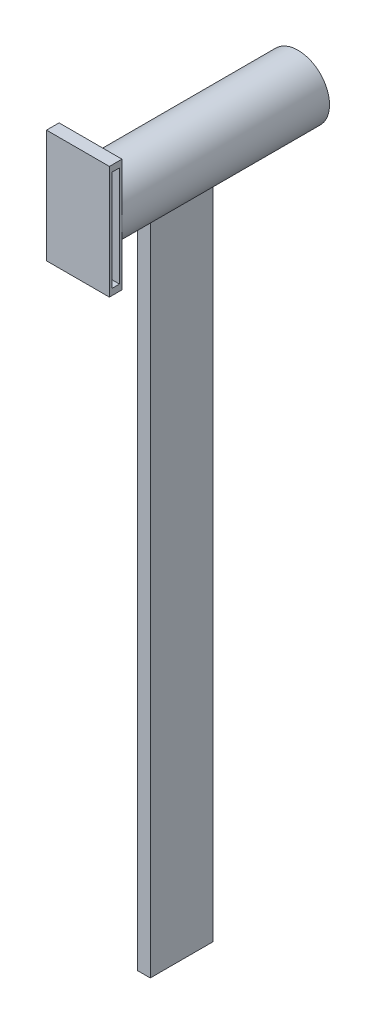
ISO-10303-21;
HEADER;
FILE_DESCRIPTION(('STEP AP214'),'2;1');
FILE_NAME('part.step','',(''),(''),'','','');
FILE_SCHEMA(('AUTOMOTIVE_DESIGN { 1 0 10303 214 1 1 1 1 }'));
ENDSEC;
DATA;
#1=APPLICATION_CONTEXT('core data for automotive mechanical design processes');
#2=APPLICATION_PROTOCOL_DEFINITION('international standard','automotive_design',2000,#1);
#3=PRODUCT_CONTEXT('',#1,'mechanical');
#4=PRODUCT('Part','Part','',(#3));
#5=PRODUCT_RELATED_PRODUCT_CATEGORY('part','',(#4));
#6=PRODUCT_DEFINITION_FORMATION('','',#4);
#7=PRODUCT_DEFINITION_CONTEXT('part definition',#1,'design');
#8=PRODUCT_DEFINITION('design','',#6,#7);
#9=PRODUCT_DEFINITION_SHAPE('','',#8);
#10=(LENGTH_UNIT() NAMED_UNIT(*) SI_UNIT(.MILLI.,.METRE.));
#11=(NAMED_UNIT(*) PLANE_ANGLE_UNIT() SI_UNIT($,.RADIAN.));
#12=(NAMED_UNIT(*) SI_UNIT($,.STERADIAN.) SOLID_ANGLE_UNIT());
#13=UNCERTAINTY_MEASURE_WITH_UNIT(LENGTH_MEASURE(1.E-05),#10,'distance_accuracy_value','');
#14=(GEOMETRIC_REPRESENTATION_CONTEXT(3) GLOBAL_UNCERTAINTY_ASSIGNED_CONTEXT((#13)) GLOBAL_UNIT_ASSIGNED_CONTEXT((#10,
#11,#12)) REPRESENTATION_CONTEXT('',''));
#15=CARTESIAN_POINT('',(0.,0.,0.));
#16=DIRECTION('',(0.,0.,1.));
#17=DIRECTION('',(1.,0.,0.));
#18=AXIS2_PLACEMENT_3D('',#15,#16,#17);
#19=CARTESIAN_POINT('',(0.,0.,0.));
#20=DIRECTION('',(0.,0.,1.));
#21=DIRECTION('',(1.,0.,0.));
#22=AXIS2_PLACEMENT_3D('',#19,#20,#21);
#23=PLANE('',#22);
#24=CARTESIAN_POINT('',(0.,0.,0.));
#25=DIRECTION('',(0.,0.,1.));
#26=DIRECTION('',(1.,0.,0.));
#27=AXIS2_PLACEMENT_3D('',#24,#25,#26);
#28=CIRCLE('',#27,2.5);
#29=CARTESIAN_POINT('',(2.5,0.,0.));
#30=VERTEX_POINT('',#29);
#31=EDGE_CURVE('E187',#30,#30,#28,.T.);
#32=ORIENTED_EDGE('',*,*,#31,.F.);
#33=EDGE_LOOP('',(#32));
#34=FACE_BOUND('',#33,.T.);
#35=ADVANCED_FACE('F37',(#34),#23,.F.);
#36=CARTESIAN_POINT('',(0.,0.,0.));
#37=DIRECTION('',(0.,0.,1.));
#38=DIRECTION('',(1.,0.,0.));
#39=AXIS2_PLACEMENT_3D('',#36,#37,#38);
#40=CYLINDRICAL_SURFACE('',#39,2.5);
#41=DIRECTION('',(0.,0.,1.));
#42=VECTOR('',#41,1.);
#43=CARTESIAN_POINT('',(-0.500000000000001,-2.44948974278318,0.));
#44=LINE('',#43,#42);
#45=CARTESIAN_POINT('',(-0.499999999999999,-2.44948974278318,12.25));
#46=VERTEX_POINT('',#45);
#47=CARTESIAN_POINT('',(-0.5,-2.44948974278318,7.25));
#48=VERTEX_POINT('',#47);
#49=EDGE_CURVE('E135',#46,#48,#44,.F.);
#50=ORIENTED_EDGE('',*,*,#49,.F.);
#51=CARTESIAN_POINT('',(0.,0.,12.25));
#52=DIRECTION('',(0.,0.,1.));
#53=DIRECTION('',(1.,0.,0.));
#54=AXIS2_PLACEMENT_3D('',#51,#52,#53);
#55=CIRCLE('',#54,2.5);
#56=CARTESIAN_POINT('',(0.500000000000001,-2.44948974278318,12.25));
#57=VERTEX_POINT('',#56);
#58=EDGE_CURVE('E155',#57,#46,#55,.F.);
#59=ORIENTED_EDGE('',*,*,#58,.F.);
#60=DIRECTION('',(0.,0.,1.));
#61=VECTOR('',#60,1.);
#62=CARTESIAN_POINT('',(0.5,-2.44948974278318,0.));
#63=LINE('',#62,#61);
#64=CARTESIAN_POINT('',(0.5,-2.44948974278318,7.25));
#65=VERTEX_POINT('',#64);
#66=EDGE_CURVE('E166',#65,#57,#63,.T.);
#67=ORIENTED_EDGE('',*,*,#66,.F.);
#68=CARTESIAN_POINT('',(0.,0.,7.25));
#69=DIRECTION('',(0.,0.,-1.));
#70=DIRECTION('',(-1.,0.,0.));
#71=AXIS2_PLACEMENT_3D('',#68,#69,#70);
#72=CIRCLE('',#71,2.5);
#73=EDGE_CURVE('E169',#48,#65,#72,.F.);
#74=ORIENTED_EDGE('',*,*,#73,.F.);
#75=EDGE_LOOP('',(#50,#59,#67,#74));
#76=FACE_BOUND('',#75,.T.);
#77=CARTESIAN_POINT('',(0.,0.,16.5));
#78=DIRECTION('',(0.,0.,1.));
#79=DIRECTION('',(1.,0.,0.));
#80=AXIS2_PLACEMENT_3D('',#77,#78,#79);
#81=CIRCLE('',#80,2.5);
#82=CARTESIAN_POINT('',(2.5,0.,16.5));
#83=VERTEX_POINT('',#82);
#84=CARTESIAN_POINT('',(-2.50000000032777,-0.000543972037433699,16.5));
#85=VERTEX_POINT('',#84);
#86=EDGE_CURVE('E151',#83,#85,#81,.T.);
#87=ORIENTED_EDGE('',*,*,#86,.F.);
#88=EDGE_CURVE('E156',#85,#83,#81,.T.);
#89=ORIENTED_EDGE('',*,*,#88,.F.);
#90=EDGE_LOOP('',(#87,#89));
#91=FACE_BOUND('',#90,.T.);
#92=ORIENTED_EDGE('',*,*,#31,.T.);
#93=EDGE_LOOP('',(#92));
#94=FACE_BOUND('',#93,.T.);
#95=ADVANCED_FACE('F39',(#76,#91,#94),#40,.T.);
#96=CARTESIAN_POINT('',(-0.5,-55.,7.25));
#97=DIRECTION('',(-1.,0.,0.));
#98=DIRECTION('',(0.,0.,1.));
#99=AXIS2_PLACEMENT_3D('',#96,#97,#98);
#100=PLANE('',#99);
#101=DIRECTION('',(0.,1.,0.));
#102=VECTOR('',#101,1.);
#103=CARTESIAN_POINT('',(-0.499999999999999,-55.,12.25));
#104=LINE('',#103,#102);
#105=CARTESIAN_POINT('',(-0.499999999999999,-55.,12.25));
#106=VERTEX_POINT('',#105);
#107=EDGE_CURVE('E179',#106,#46,#104,.T.);
#108=ORIENTED_EDGE('',*,*,#107,.T.);
#109=ORIENTED_EDGE('',*,*,#49,.T.);
#110=DIRECTION('',(0.,1.,0.));
#111=VECTOR('',#110,1.);
#112=CARTESIAN_POINT('',(-0.5,-55.,7.25));
#113=LINE('',#112,#111);
#114=CARTESIAN_POINT('',(-0.5,-55.,7.25));
#115=VERTEX_POINT('',#114);
#116=EDGE_CURVE('E177',#115,#48,#113,.T.);
#117=ORIENTED_EDGE('',*,*,#116,.F.);
#118=DIRECTION('',(0.,0.,1.));
#119=VECTOR('',#118,1.);
#120=CARTESIAN_POINT('',(-0.5,-55.,7.25));
#121=LINE('',#120,#119);
#122=EDGE_CURVE('E331',#115,#106,#121,.T.);
#123=ORIENTED_EDGE('',*,*,#122,.T.);
#124=EDGE_LOOP('',(#108,#109,#117,#123));
#125=FACE_BOUND('',#124,.T.);
#126=ADVANCED_FACE('F175',(#125),#100,.T.);
#127=CARTESIAN_POINT('',(-0.5,-55.,7.25));
#128=DIRECTION('',(0.,0.,-1.));
#129=DIRECTION('',(-1.,0.,0.));
#130=AXIS2_PLACEMENT_3D('',#127,#128,#129);
#131=PLANE('',#130);
#132=ORIENTED_EDGE('',*,*,#116,.T.);
#133=ORIENTED_EDGE('',*,*,#73,.T.);
#134=DIRECTION('',(0.,1.,0.));
#135=VECTOR('',#134,1.);
#136=CARTESIAN_POINT('',(0.500000000000001,-55.,7.25));
#137=LINE('',#136,#135);
#138=CARTESIAN_POINT('',(0.500000000000001,-55.,7.25));
#139=VERTEX_POINT('',#138);
#140=EDGE_CURVE('E188',#139,#65,#137,.T.);
#141=ORIENTED_EDGE('',*,*,#140,.F.);
#142=DIRECTION('',(-1.,0.,0.));
#143=VECTOR('',#142,1.);
#144=CARTESIAN_POINT('',(-0.5,-55.,7.25));
#145=LINE('',#144,#143);
#146=EDGE_CURVE('E186',#139,#115,#145,.T.);
#147=ORIENTED_EDGE('',*,*,#146,.T.);
#148=EDGE_LOOP('',(#132,#133,#141,#147));
#149=FACE_BOUND('',#148,.T.);
#150=ADVANCED_FACE('F183',(#149),#131,.T.);
#151=CARTESIAN_POINT('',(0.500000000000001,-55.,7.25));
#152=DIRECTION('',(1.,0.,0.));
#153=DIRECTION('',(0.,0.,-1.));
#154=AXIS2_PLACEMENT_3D('',#151,#152,#153);
#155=PLANE('',#154);
#156=ORIENTED_EDGE('',*,*,#140,.T.);
#157=ORIENTED_EDGE('',*,*,#66,.T.);
#158=DIRECTION('',(0.,1.,0.));
#159=VECTOR('',#158,1.);
#160=CARTESIAN_POINT('',(0.500000000000001,-55.,12.25));
#161=LINE('',#160,#159);
#162=CARTESIAN_POINT('',(0.500000000000001,-55.,12.25));
#163=VERTEX_POINT('',#162);
#164=EDGE_CURVE('E191',#163,#57,#161,.T.);
#165=ORIENTED_EDGE('',*,*,#164,.F.);
#166=DIRECTION('',(0.,0.,-1.));
#167=VECTOR('',#166,1.);
#168=CARTESIAN_POINT('',(0.500000000000001,-55.,7.25));
#169=LINE('',#168,#167);
#170=EDGE_CURVE('E336',#163,#139,#169,.T.);
#171=ORIENTED_EDGE('',*,*,#170,.T.);
#172=EDGE_LOOP('',(#156,#157,#165,#171));
#173=FACE_BOUND('',#172,.T.);
#174=ADVANCED_FACE('F228',(#173),#155,.T.);
#175=CARTESIAN_POINT('',(-0.499999999999999,-55.,12.25));
#176=DIRECTION('',(0.,0.,1.));
#177=DIRECTION('',(1.,0.,0.));
#178=AXIS2_PLACEMENT_3D('',#175,#176,#177);
#179=PLANE('',#178);
#180=ORIENTED_EDGE('',*,*,#164,.T.);
#181=ORIENTED_EDGE('',*,*,#58,.T.);
#182=ORIENTED_EDGE('',*,*,#107,.F.);
#183=DIRECTION('',(1.,0.,0.));
#184=VECTOR('',#183,1.);
#185=CARTESIAN_POINT('',(-0.499999999999999,-55.,12.25));
#186=LINE('',#185,#184);
#187=EDGE_CURVE('E334',#106,#163,#186,.T.);
#188=ORIENTED_EDGE('',*,*,#187,.T.);
#189=EDGE_LOOP('',(#180,#181,#182,#188));
#190=FACE_BOUND('',#189,.T.);
#191=ADVANCED_FACE('F224',(#190),#179,.T.);
#192=CARTESIAN_POINT('',(0.,-55.,0.));
#193=DIRECTION('',(0.,1.,0.));
#194=DIRECTION('',(0.,0.,1.));
#195=AXIS2_PLACEMENT_3D('',#192,#193,#194);
#196=PLANE('',#195);
#197=ORIENTED_EDGE('',*,*,#122,.F.);
#198=ORIENTED_EDGE('',*,*,#146,.F.);
#199=ORIENTED_EDGE('',*,*,#170,.F.);
#200=ORIENTED_EDGE('',*,*,#187,.F.);
#201=EDGE_LOOP('',(#197,#198,#199,#200));
#202=FACE_BOUND('',#201,.T.);
#203=ADVANCED_FACE('F227',(#202),#196,.F.);
#204=CARTESIAN_POINT('',(0.,0.,16.5));
#205=DIRECTION('',(0.,0.,1.));
#206=DIRECTION('',(1.,0.,0.));
#207=AXIS2_PLACEMENT_3D('',#204,#205,#206);
#208=PLANE('',#207);
#209=DIRECTION('',(0.,-1.,0.));
#210=VECTOR('',#209,1.);
#211=CARTESIAN_POINT('',(2.5,0.,16.5));
#212=LINE('',#211,#210);
#213=CARTESIAN_POINT('',(2.5,4.5,16.5));
#214=VERTEX_POINT('',#213);
#215=EDGE_CURVE('E317',#214,#83,#212,.T.);
#216=ORIENTED_EDGE('',*,*,#215,.T.);
#217=ORIENTED_EDGE('',*,*,#86,.T.);
#218=DIRECTION('',(0.,-1.,0.));
#219=VECTOR('',#218,1.);
#220=CARTESIAN_POINT('',(-2.5,0.,16.5));
#221=LINE('',#220,#219);
#222=CARTESIAN_POINT('',(-2.5,4.5,16.5));
#223=VERTEX_POINT('',#222);
#224=EDGE_CURVE('E312',#223,#85,#221,.T.);
#225=ORIENTED_EDGE('',*,*,#224,.F.);
#226=DIRECTION('',(1.,0.,0.));
#227=VECTOR('',#226,1.);
#228=CARTESIAN_POINT('',(0.,4.5,16.5));
#229=LINE('',#228,#227);
#230=EDGE_CURVE('E295',#223,#214,#229,.T.);
#231=ORIENTED_EDGE('',*,*,#230,.T.);
#232=EDGE_LOOP('',(#216,#217,#225,#231));
#233=FACE_BOUND('',#232,.T.);
#234=ADVANCED_FACE('F237',(#233),#208,.F.);
#235=CARTESIAN_POINT('',(-2.5,-4.5,16.5));
#236=VERTEX_POINT('',#235);
#237=EDGE_CURVE('E290',#85,#236,#221,.T.);
#238=ORIENTED_EDGE('',*,*,#237,.F.);
#239=ORIENTED_EDGE('',*,*,#88,.T.);
#240=CARTESIAN_POINT('',(2.5,-4.5,16.5));
#241=VERTEX_POINT('',#240);
#242=EDGE_CURVE('E315',#83,#241,#212,.T.);
#243=ORIENTED_EDGE('',*,*,#242,.T.);
#244=DIRECTION('',(1.,0.,0.));
#245=VECTOR('',#244,1.);
#246=CARTESIAN_POINT('',(0.,-4.5,16.5));
#247=LINE('',#246,#245);
#248=EDGE_CURVE('E306',#236,#241,#247,.T.);
#249=ORIENTED_EDGE('',*,*,#248,.F.);
#250=EDGE_LOOP('',(#238,#239,#243,#249));
#251=FACE_BOUND('',#250,.T.);
#252=ADVANCED_FACE('F243',(#251),#208,.F.);
#253=CARTESIAN_POINT('',(-2.5,0.,17.5));
#254=DIRECTION('',(1.,0.,0.));
#255=DIRECTION('',(0.,0.,-1.));
#256=AXIS2_PLACEMENT_3D('',#253,#254,#255);
#257=PLANE('',#256);
#258=DIRECTION('',(0.,0.,1.));
#259=VECTOR('',#258,1.);
#260=CARTESIAN_POINT('',(-2.5,4.,17.5));
#261=LINE('',#260,#259);
#262=CARTESIAN_POINT('',(-2.5,4.,16.7));
#263=VERTEX_POINT('',#262);
#264=CARTESIAN_POINT('',(-2.5,4.,17.3));
#265=VERTEX_POINT('',#264);
#266=EDGE_CURVE('E277',#263,#265,#261,.T.);
#267=ORIENTED_EDGE('',*,*,#266,.T.);
#268=DIRECTION('',(0.,-1.,0.));
#269=VECTOR('',#268,1.);
#270=CARTESIAN_POINT('',(-2.5,0.,17.3));
#271=LINE('',#270,#269);
#272=CARTESIAN_POINT('',(-2.5,-4.,17.3));
#273=VERTEX_POINT('',#272);
#274=EDGE_CURVE('E287',#265,#273,#271,.T.);
#275=ORIENTED_EDGE('',*,*,#274,.T.);
#276=DIRECTION('',(0.,0.,-1.));
#277=VECTOR('',#276,1.);
#278=CARTESIAN_POINT('',(-2.5,-4.,17.5));
#279=LINE('',#278,#277);
#280=CARTESIAN_POINT('',(-2.5,-4.,16.7));
#281=VERTEX_POINT('',#280);
#282=EDGE_CURVE('E280',#273,#281,#279,.T.);
#283=ORIENTED_EDGE('',*,*,#282,.T.);
#284=DIRECTION('',(0.,1.,0.));
#285=VECTOR('',#284,1.);
#286=CARTESIAN_POINT('',(-2.5,0.,16.7));
#287=LINE('',#286,#285);
#288=EDGE_CURVE('E142',#281,#263,#287,.T.);
#289=ORIENTED_EDGE('',*,*,#288,.T.);
#290=EDGE_LOOP('',(#267,#275,#283,#289));
#291=FACE_BOUND('',#290,.T.);
#292=ORIENTED_EDGE('',*,*,#224,.T.);
#293=ORIENTED_EDGE('',*,*,#237,.T.);
#294=DIRECTION('',(0.,0.,-1.));
#295=VECTOR('',#294,1.);
#296=CARTESIAN_POINT('',(-2.5,-4.5,17.5));
#297=LINE('',#296,#295);
#298=CARTESIAN_POINT('',(-2.5,-4.5,17.5));
#299=VERTEX_POINT('',#298);
#300=EDGE_CURVE('E329',#299,#236,#297,.T.);
#301=ORIENTED_EDGE('',*,*,#300,.F.);
#302=DIRECTION('',(0.,-1.,0.));
#303=VECTOR('',#302,1.);
#304=CARTESIAN_POINT('',(-2.5,0.,17.5));
#305=LINE('',#304,#303);
#306=CARTESIAN_POINT('',(-2.5,4.5,17.5));
#307=VERTEX_POINT('',#306);
#308=EDGE_CURVE('E291',#307,#299,#305,.T.);
#309=ORIENTED_EDGE('',*,*,#308,.F.);
#310=DIRECTION('',(0.,0.,-1.));
#311=VECTOR('',#310,1.);
#312=CARTESIAN_POINT('',(-2.5,4.5,17.5));
#313=LINE('',#312,#311);
#314=EDGE_CURVE('E303',#307,#223,#313,.T.);
#315=ORIENTED_EDGE('',*,*,#314,.T.);
#316=EDGE_LOOP('',(#292,#293,#301,#309,#315));
#317=FACE_BOUND('',#316,.T.);
#318=ADVANCED_FACE('F239',(#291,#317),#257,.F.);
#319=CARTESIAN_POINT('',(0.,-4.5,17.5));
#320=DIRECTION('',(0.,1.,0.));
#321=DIRECTION('',(0.,0.,1.));
#322=AXIS2_PLACEMENT_3D('',#319,#320,#321);
#323=PLANE('',#322);
#324=ORIENTED_EDGE('',*,*,#248,.T.);
#325=DIRECTION('',(0.,0.,-1.));
#326=VECTOR('',#325,1.);
#327=CARTESIAN_POINT('',(2.5,-4.5,17.5));
#328=LINE('',#327,#326);
#329=CARTESIAN_POINT('',(2.5,-4.5,17.5));
#330=VERTEX_POINT('',#329);
#331=EDGE_CURVE('E327',#330,#241,#328,.T.);
#332=ORIENTED_EDGE('',*,*,#331,.F.);
#333=DIRECTION('',(1.,0.,0.));
#334=VECTOR('',#333,1.);
#335=CARTESIAN_POINT('',(0.,-4.5,17.5));
#336=LINE('',#335,#334);
#337=EDGE_CURVE('E294',#299,#330,#336,.T.);
#338=ORIENTED_EDGE('',*,*,#337,.F.);
#339=ORIENTED_EDGE('',*,*,#300,.T.);
#340=EDGE_LOOP('',(#324,#332,#338,#339));
#341=FACE_BOUND('',#340,.T.);
#342=ADVANCED_FACE('F242',(#341),#323,.F.);
#343=CARTESIAN_POINT('',(2.5,0.,17.5));
#344=DIRECTION('',(1.,0.,0.));
#345=DIRECTION('',(0.,0.,-1.));
#346=AXIS2_PLACEMENT_3D('',#343,#344,#345);
#347=PLANE('',#346);
#348=DIRECTION('',(0.,-1.,0.));
#349=VECTOR('',#348,1.);
#350=CARTESIAN_POINT('',(2.5,0.,17.3));
#351=LINE('',#350,#349);
#352=CARTESIAN_POINT('',(2.5,4.,17.3));
#353=VERTEX_POINT('',#352);
#354=CARTESIAN_POINT('',(2.5,-4.,17.3));
#355=VERTEX_POINT('',#354);
#356=EDGE_CURVE('E12',#353,#355,#351,.T.);
#357=ORIENTED_EDGE('',*,*,#356,.F.);
#358=DIRECTION('',(0.,0.,1.));
#359=VECTOR('',#358,1.);
#360=CARTESIAN_POINT('',(2.5,4.,17.5));
#361=LINE('',#360,#359);
#362=CARTESIAN_POINT('',(2.5,4.,16.7));
#363=VERTEX_POINT('',#362);
#364=EDGE_CURVE('E46',#363,#353,#361,.T.);
#365=ORIENTED_EDGE('',*,*,#364,.F.);
#366=DIRECTION('',(0.,1.,0.));
#367=VECTOR('',#366,1.);
#368=CARTESIAN_POINT('',(2.5,0.,16.7));
#369=LINE('',#368,#367);
#370=CARTESIAN_POINT('',(2.5,-4.,16.7));
#371=VERTEX_POINT('',#370);
#372=EDGE_CURVE('E134',#371,#363,#369,.T.);
#373=ORIENTED_EDGE('',*,*,#372,.F.);
#374=DIRECTION('',(0.,0.,-1.));
#375=VECTOR('',#374,1.);
#376=CARTESIAN_POINT('',(2.5,-4.,17.5));
#377=LINE('',#376,#375);
#378=EDGE_CURVE('E129',#355,#371,#377,.T.);
#379=ORIENTED_EDGE('',*,*,#378,.F.);
#380=EDGE_LOOP('',(#357,#365,#373,#379));
#381=FACE_BOUND('',#380,.T.);
#382=ORIENTED_EDGE('',*,*,#215,.F.);
#383=DIRECTION('',(0.,0.,-1.));
#384=VECTOR('',#383,1.);
#385=CARTESIAN_POINT('',(2.5,4.5,17.5));
#386=LINE('',#385,#384);
#387=CARTESIAN_POINT('',(2.5,4.5,17.5));
#388=VERTEX_POINT('',#387);
#389=EDGE_CURVE('E325',#388,#214,#386,.T.);
#390=ORIENTED_EDGE('',*,*,#389,.F.);
#391=DIRECTION('',(0.,-1.,0.));
#392=VECTOR('',#391,1.);
#393=CARTESIAN_POINT('',(2.5,0.,17.5));
#394=LINE('',#393,#392);
#395=EDGE_CURVE('E297',#388,#330,#394,.T.);
#396=ORIENTED_EDGE('',*,*,#395,.T.);
#397=ORIENTED_EDGE('',*,*,#331,.T.);
#398=ORIENTED_EDGE('',*,*,#242,.F.);
#399=EDGE_LOOP('',(#382,#390,#396,#397,#398));
#400=FACE_BOUND('',#399,.T.);
#401=ADVANCED_FACE('F147',(#381,#400),#347,.T.);
#402=CARTESIAN_POINT('',(0.,4.5,17.5));
#403=DIRECTION('',(0.,1.,0.));
#404=DIRECTION('',(0.,0.,1.));
#405=AXIS2_PLACEMENT_3D('',#402,#403,#404);
#406=PLANE('',#405);
#407=ORIENTED_EDGE('',*,*,#230,.F.);
#408=ORIENTED_EDGE('',*,*,#314,.F.);
#409=DIRECTION('',(1.,0.,0.));
#410=VECTOR('',#409,1.);
#411=CARTESIAN_POINT('',(0.,4.5,17.5));
#412=LINE('',#411,#410);
#413=EDGE_CURVE('E300',#307,#388,#412,.T.);
#414=ORIENTED_EDGE('',*,*,#413,.T.);
#415=ORIENTED_EDGE('',*,*,#389,.T.);
#416=EDGE_LOOP('',(#407,#408,#414,#415));
#417=FACE_BOUND('',#416,.T.);
#418=ADVANCED_FACE('F250',(#417),#406,.T.);
#419=CARTESIAN_POINT('',(0.,0.,17.5));
#420=DIRECTION('',(0.,0.,1.));
#421=DIRECTION('',(1.,0.,0.));
#422=AXIS2_PLACEMENT_3D('',#419,#420,#421);
#423=PLANE('',#422);
#424=ORIENTED_EDGE('',*,*,#308,.T.);
#425=ORIENTED_EDGE('',*,*,#337,.T.);
#426=ORIENTED_EDGE('',*,*,#395,.F.);
#427=ORIENTED_EDGE('',*,*,#413,.F.);
#428=EDGE_LOOP('',(#424,#425,#426,#427));
#429=FACE_BOUND('',#428,.T.);
#430=ADVANCED_FACE('F253',(#429),#423,.T.);
#431=CARTESIAN_POINT('',(-2.54813679899192,4.,17.3));
#432=DIRECTION('',(0.,0.,1.));
#433=DIRECTION('',(1.,0.,0.));
#434=AXIS2_PLACEMENT_3D('',#431,#432,#433);
#435=PLANE('',#434);
#436=DIRECTION('',(1.,0.,0.));
#437=VECTOR('',#436,1.);
#438=CARTESIAN_POINT('',(-2.54813679899192,4.,17.3));
#439=LINE('',#438,#437);
#440=EDGE_CURVE('E278',#265,#353,#439,.T.);
#441=ORIENTED_EDGE('',*,*,#440,.T.);
#442=ORIENTED_EDGE('',*,*,#356,.T.);
#443=DIRECTION('',(1.,0.,0.));
#444=VECTOR('',#443,1.);
#445=CARTESIAN_POINT('',(-2.54813679899192,-4.,17.3));
#446=LINE('',#445,#444);
#447=EDGE_CURVE('E58',#273,#355,#446,.T.);
#448=ORIENTED_EDGE('',*,*,#447,.F.);
#449=ORIENTED_EDGE('',*,*,#274,.F.);
#450=EDGE_LOOP('',(#441,#442,#448,#449));
#451=FACE_BOUND('',#450,.T.);
#452=ADVANCED_FACE('F260',(#451),#435,.F.);
#453=CARTESIAN_POINT('',(-2.54813679899192,4.,17.3));
#454=DIRECTION('',(0.,1.,0.));
#455=DIRECTION('',(0.,0.,1.));
#456=AXIS2_PLACEMENT_3D('',#453,#454,#455);
#457=PLANE('',#456);
#458=DIRECTION('',(1.,0.,0.));
#459=VECTOR('',#458,1.);
#460=CARTESIAN_POINT('',(-2.54813679899192,4.,16.7));
#461=LINE('',#460,#459);
#462=EDGE_CURVE('E144',#263,#363,#461,.T.);
#463=ORIENTED_EDGE('',*,*,#462,.T.);
#464=ORIENTED_EDGE('',*,*,#364,.T.);
#465=ORIENTED_EDGE('',*,*,#440,.F.);
#466=ORIENTED_EDGE('',*,*,#266,.F.);
#467=EDGE_LOOP('',(#463,#464,#465,#466));
#468=FACE_BOUND('',#467,.T.);
#469=ADVANCED_FACE('F264',(#468),#457,.F.);
#470=CARTESIAN_POINT('',(-2.54813679899192,4.,16.7));
#471=DIRECTION('',(0.,0.,-1.));
#472=DIRECTION('',(-1.,0.,0.));
#473=AXIS2_PLACEMENT_3D('',#470,#471,#472);
#474=PLANE('',#473);
#475=DIRECTION('',(1.,0.,0.));
#476=VECTOR('',#475,1.);
#477=CARTESIAN_POINT('',(-2.54813679899192,-4.,16.7));
#478=LINE('',#477,#476);
#479=EDGE_CURVE('E53',#281,#371,#478,.T.);
#480=ORIENTED_EDGE('',*,*,#479,.T.);
#481=ORIENTED_EDGE('',*,*,#372,.T.);
#482=ORIENTED_EDGE('',*,*,#462,.F.);
#483=ORIENTED_EDGE('',*,*,#288,.F.);
#484=EDGE_LOOP('',(#480,#481,#482,#483));
#485=FACE_BOUND('',#484,.T.);
#486=ADVANCED_FACE('F138',(#485),#474,.F.);
#487=CARTESIAN_POINT('',(-2.54813679899192,-4.,17.3));
#488=DIRECTION('',(0.,-1.,0.));
#489=DIRECTION('',(0.,0.,-1.));
#490=AXIS2_PLACEMENT_3D('',#487,#488,#489);
#491=PLANE('',#490);
#492=ORIENTED_EDGE('',*,*,#447,.T.);
#493=ORIENTED_EDGE('',*,*,#378,.T.);
#494=ORIENTED_EDGE('',*,*,#479,.F.);
#495=ORIENTED_EDGE('',*,*,#282,.F.);
#496=EDGE_LOOP('',(#492,#493,#494,#495));
#497=FACE_BOUND('',#496,.T.);
#498=ADVANCED_FACE('F130',(#497),#491,.F.);
#499=CLOSED_SHELL('',(#35,#95,#126,#150,#174,#191,#203,#234,#252,#318,#342,#401,#418,#430,#452,
#469,#486,#498));
#500=MANIFOLD_SOLID_BREP('B2',#499);
#501=ADVANCED_BREP_SHAPE_REPRESENTATION('',(#18,#500),#14);
#502=SHAPE_DEFINITION_REPRESENTATION(#9,#501);
ENDSEC;
END-ISO-10303-21;
